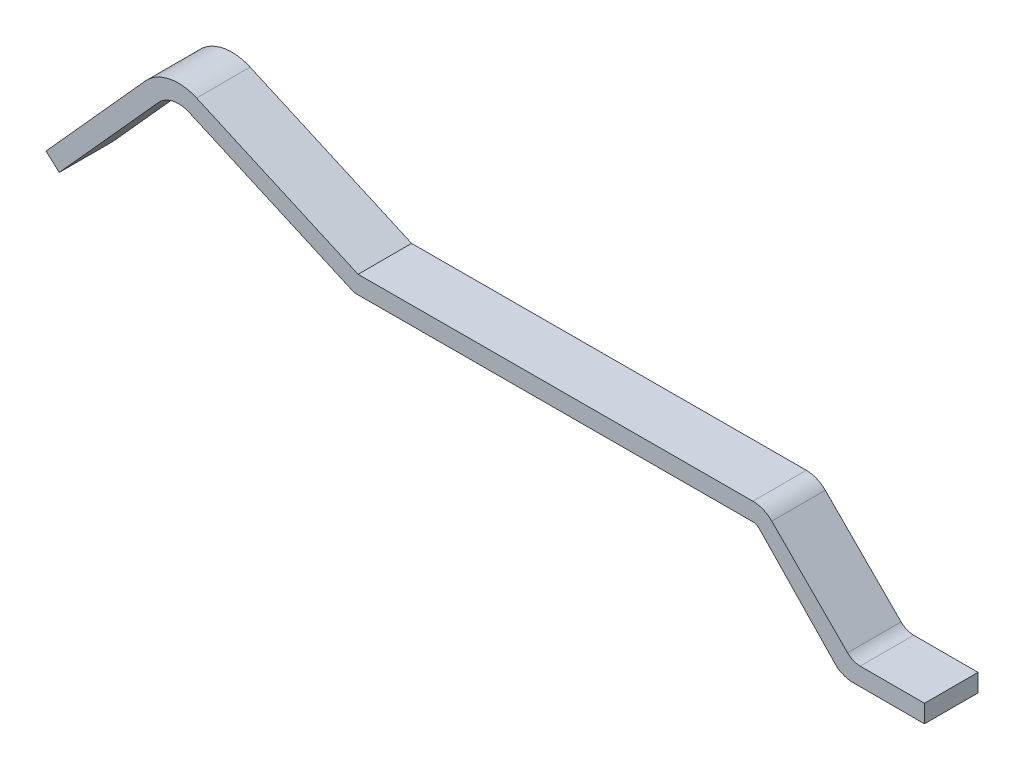
ISO-10303-21;
HEADER;
FILE_DESCRIPTION(('STEP AP214'),'2;1');
FILE_NAME('part.step','',(''),(''),'','','');
FILE_SCHEMA(('AUTOMOTIVE_DESIGN { 1 0 10303 214 1 1 1 1 }'));
ENDSEC;
DATA;
#1=APPLICATION_CONTEXT('core data for automotive mechanical design processes');
#2=APPLICATION_PROTOCOL_DEFINITION('international standard','automotive_design',2000,#1);
#3=PRODUCT_CONTEXT('',#1,'mechanical');
#4=PRODUCT('Part','Part','',(#3));
#5=PRODUCT_RELATED_PRODUCT_CATEGORY('part','',(#4));
#6=PRODUCT_DEFINITION_FORMATION('','',#4);
#7=PRODUCT_DEFINITION_CONTEXT('part definition',#1,'design');
#8=PRODUCT_DEFINITION('design','',#6,#7);
#9=PRODUCT_DEFINITION_SHAPE('','',#8);
#10=(LENGTH_UNIT() NAMED_UNIT(*) SI_UNIT(.MILLI.,.METRE.));
#11=(NAMED_UNIT(*) PLANE_ANGLE_UNIT() SI_UNIT($,.RADIAN.));
#12=(NAMED_UNIT(*) SI_UNIT($,.STERADIAN.) SOLID_ANGLE_UNIT());
#13=UNCERTAINTY_MEASURE_WITH_UNIT(LENGTH_MEASURE(1.E-05),#10,'distance_accuracy_value','');
#14=(GEOMETRIC_REPRESENTATION_CONTEXT(3) GLOBAL_UNCERTAINTY_ASSIGNED_CONTEXT((#13)) GLOBAL_UNIT_ASSIGNED_CONTEXT((#10,
#11,#12)) REPRESENTATION_CONTEXT('',''));
#15=CARTESIAN_POINT('',(0.,0.,0.));
#16=DIRECTION('',(0.,0.,1.));
#17=DIRECTION('',(1.,0.,0.));
#18=AXIS2_PLACEMENT_3D('',#15,#16,#17);
#19=CARTESIAN_POINT('',(18.078994901728,0.200000000000047,0.3));
#20=DIRECTION('',(0.,-1.,0.));
#21=DIRECTION('',(1.,0.,0.));
#22=AXIS2_PLACEMENT_3D('',#19,#20,#21);
#23=PLANE('',#22);
#24=DIRECTION('',(0.,0.,-1.));
#25=VECTOR('',#24,1.);
#26=CARTESIAN_POINT('',(18.078994901728,0.200000000000048,0.3));
#27=LINE('',#26,#25);
#28=CARTESIAN_POINT('',(18.078994901728,0.200000000000047,-0.3));
#29=VERTEX_POINT('',#28);
#30=CARTESIAN_POINT('',(18.078994901728,0.200000000000047,0.3));
#31=VERTEX_POINT('',#30);
#32=EDGE_CURVE('E232',#29,#31,#27,.F.);
#33=ORIENTED_EDGE('',*,*,#32,.T.);
#34=DIRECTION('',(-1.,0.,0.));
#35=VECTOR('',#34,1.);
#36=CARTESIAN_POINT('',(18.,0.200000000000047,0.3));
#37=LINE('',#36,#35);
#38=CARTESIAN_POINT('',(18.8,0.200000000000047,0.3));
#39=VERTEX_POINT('',#38);
#40=EDGE_CURVE('E188',#31,#39,#37,.F.);
#41=ORIENTED_EDGE('',*,*,#40,.T.);
#42=DIRECTION('',(0.,0.,1.));
#43=VECTOR('',#42,1.);
#44=CARTESIAN_POINT('',(18.8,0.200000000000047,0.3));
#45=LINE('',#44,#43);
#46=CARTESIAN_POINT('',(18.8,0.200000000000047,-0.3));
#47=VERTEX_POINT('',#46);
#48=EDGE_CURVE('E276',#39,#47,#45,.F.);
#49=ORIENTED_EDGE('',*,*,#48,.T.);
#50=DIRECTION('',(-1.,0.,0.));
#51=VECTOR('',#50,1.);
#52=CARTESIAN_POINT('',(18.,0.200000000000047,-0.3));
#53=LINE('',#52,#51);
#54=EDGE_CURVE('E271',#29,#47,#53,.F.);
#55=ORIENTED_EDGE('',*,*,#54,.F.);
#56=EDGE_LOOP('',(#33,#41,#49,#55));
#57=FACE_BOUND('',#56,.T.);
#58=ADVANCED_FACE('F17',(#57),#23,.F.);
#59=CARTESIAN_POINT('',(18.8,0.200000000000047,0.3));
#60=DIRECTION('',(-1.,0.,0.));
#61=DIRECTION('',(0.,0.,1.));
#62=AXIS2_PLACEMENT_3D('',#59,#60,#61);
#63=PLANE('',#62);
#64=ORIENTED_EDGE('',*,*,#48,.F.);
#65=DIRECTION('',(0.,1.,0.));
#66=VECTOR('',#65,1.);
#67=CARTESIAN_POINT('',(18.8,0.300000000000376,0.3));
#68=LINE('',#67,#66);
#69=CARTESIAN_POINT('',(18.8,0.,0.3));
#70=VERTEX_POINT('',#69);
#71=EDGE_CURVE('E226',#39,#70,#68,.F.);
#72=ORIENTED_EDGE('',*,*,#71,.T.);
#73=DIRECTION('',(0.,0.,1.));
#74=VECTOR('',#73,1.);
#75=CARTESIAN_POINT('',(18.8,0.,0.3));
#76=LINE('',#75,#74);
#77=CARTESIAN_POINT('',(18.8,0.,-0.3));
#78=VERTEX_POINT('',#77);
#79=EDGE_CURVE('E97',#70,#78,#76,.F.);
#80=ORIENTED_EDGE('',*,*,#79,.T.);
#81=DIRECTION('',(0.,1.,0.));
#82=VECTOR('',#81,1.);
#83=CARTESIAN_POINT('',(18.8,0.300000000000376,-0.3));
#84=LINE('',#83,#82);
#85=EDGE_CURVE('E279',#47,#78,#84,.F.);
#86=ORIENTED_EDGE('',*,*,#85,.F.);
#87=EDGE_LOOP('',(#64,#72,#80,#86));
#88=FACE_BOUND('',#87,.T.);
#89=ADVANCED_FACE('F343',(#88),#63,.F.);
#90=CARTESIAN_POINT('',(18.8,0.,0.3));
#91=DIRECTION('',(0.,1.,0.));
#92=DIRECTION('',(-1.,0.,0.));
#93=AXIS2_PLACEMENT_3D('',#90,#91,#92);
#94=PLANE('',#93);
#95=ORIENTED_EDGE('',*,*,#79,.F.);
#96=DIRECTION('',(-1.,0.,0.));
#97=VECTOR('',#96,1.);
#98=CARTESIAN_POINT('',(18.,0.,0.3));
#99=LINE('',#98,#97);
#100=CARTESIAN_POINT('',(18.,0.,0.3));
#101=VERTEX_POINT('',#100);
#102=EDGE_CURVE('E224',#70,#101,#99,.T.);
#103=ORIENTED_EDGE('',*,*,#102,.T.);
#104=DIRECTION('',(0.,0.,-1.));
#105=VECTOR('',#104,1.);
#106=CARTESIAN_POINT('',(18.,0.,0.3));
#107=LINE('',#106,#105);
#108=CARTESIAN_POINT('',(18.,0.,-0.3));
#109=VERTEX_POINT('',#108);
#110=EDGE_CURVE('E87',#109,#101,#107,.F.);
#111=ORIENTED_EDGE('',*,*,#110,.F.);
#112=DIRECTION('',(-1.,0.,0.));
#113=VECTOR('',#112,1.);
#114=CARTESIAN_POINT('',(18.,0.,-0.3));
#115=LINE('',#114,#113);
#116=EDGE_CURVE('E282',#78,#109,#115,.T.);
#117=ORIENTED_EDGE('',*,*,#116,.F.);
#118=EDGE_LOOP('',(#95,#103,#111,#117));
#119=FACE_BOUND('',#118,.T.);
#120=ADVANCED_FACE('F344',(#119),#94,.F.);
#121=CARTESIAN_POINT('',(18.,0.300000000000376,0.3));
#122=DIRECTION('',(0.,0.,-1.));
#123=DIRECTION('',(-1.,0.,0.));
#124=AXIS2_PLACEMENT_3D('',#121,#122,#123);
#125=CYLINDRICAL_SURFACE('',#124,0.300000000000359);
#126=CARTESIAN_POINT('',(18.,0.300000000000376,0.3));
#127=DIRECTION('',(0.,0.,-1.));
#128=DIRECTION('',(-1.,0.,0.));
#129=AXIS2_PLACEMENT_3D('',#126,#127,#128);
#130=CIRCLE('',#129,0.300000000000359);
#131=CARTESIAN_POINT('',(17.82,0.0599999999999437,0.3));
#132=VERTEX_POINT('',#131);
#133=EDGE_CURVE('E20',#101,#132,#130,.T.);
#134=ORIENTED_EDGE('',*,*,#133,.T.);
#135=DIRECTION('',(0.,0.,1.));
#136=VECTOR('',#135,1.);
#137=CARTESIAN_POINT('',(17.82,0.0599999999999465,0.3));
#138=LINE('',#137,#136);
#139=CARTESIAN_POINT('',(17.82,0.0599999999999437,-0.3));
#140=VERTEX_POINT('',#139);
#141=EDGE_CURVE('E160',#132,#140,#138,.F.);
#142=ORIENTED_EDGE('',*,*,#141,.T.);
#143=CARTESIAN_POINT('',(18.,0.300000000000376,-0.3));
#144=DIRECTION('',(0.,0.,-1.));
#145=DIRECTION('',(-1.,0.,0.));
#146=AXIS2_PLACEMENT_3D('',#143,#144,#145);
#147=CIRCLE('',#146,0.300000000000359);
#148=EDGE_CURVE('E306',#109,#140,#147,.T.);
#149=ORIENTED_EDGE('',*,*,#148,.F.);
#150=ORIENTED_EDGE('',*,*,#110,.T.);
#151=EDGE_LOOP('',(#134,#142,#149,#150));
#152=FACE_BOUND('',#151,.T.);
#153=ADVANCED_FACE('F346',(#152),#125,.T.);
#154=CARTESIAN_POINT('',(17.82,0.0599999999999465,0.3));
#155=DIRECTION('',(0.721675803920417,0.692231199842813,0.));
#156=DIRECTION('',(-0.692231199842813,0.721675803920417,0.));
#157=AXIS2_PLACEMENT_3D('',#154,#155,#156);
#158=PLANE('',#157);
#159=ORIENTED_EDGE('',*,*,#141,.F.);
#160=DIRECTION('',(-0.692231199842813,0.721675803920417,0.));
#161=VECTOR('',#160,1.);
#162=CARTESIAN_POINT('',(17.82,0.0599999999999465,0.3));
#163=LINE('',#162,#161);
#164=CARTESIAN_POINT('',(16.9464466094064,0.970710678119103,0.3));
#165=VERTEX_POINT('',#164);
#166=EDGE_CURVE('E172',#132,#165,#163,.T.);
#167=ORIENTED_EDGE('',*,*,#166,.T.);
#168=DIRECTION('',(0.,0.,-1.));
#169=VECTOR('',#168,1.);
#170=CARTESIAN_POINT('',(16.9464466094068,0.97071067811864,0.3));
#171=LINE('',#170,#169);
#172=CARTESIAN_POINT('',(16.9464466094064,0.970710678119103,-0.3));
#173=VERTEX_POINT('',#172);
#174=EDGE_CURVE('E268',#165,#173,#171,.T.);
#175=ORIENTED_EDGE('',*,*,#174,.T.);
#176=DIRECTION('',(-0.692231199842813,0.721675803920417,0.));
#177=VECTOR('',#176,1.);
#178=CARTESIAN_POINT('',(17.82,0.0599999999999465,-0.3));
#179=LINE('',#178,#177);
#180=EDGE_CURVE('E305',#140,#173,#179,.T.);
#181=ORIENTED_EDGE('',*,*,#180,.F.);
#182=EDGE_LOOP('',(#159,#167,#175,#181));
#183=FACE_BOUND('',#182,.T.);
#184=ADVANCED_FACE('F349',(#183),#158,.F.);
#185=CARTESIAN_POINT('',(12.407488687666,0.99,0.3));
#186=DIRECTION('',(0.40673664307565,0.913545457642668,0.));
#187=DIRECTION('',(-0.913545457642668,0.40673664307565,0.));
#188=AXIS2_PLACEMENT_3D('',#185,#186,#187);
#189=PLANE('',#188);
#190=DIRECTION('',(0.,0.,1.));
#191=VECTOR('',#190,1.);
#192=CARTESIAN_POINT('',(12.407488687666,0.99,0.3));
#193=LINE('',#192,#191);
#194=CARTESIAN_POINT('',(12.407488687666,0.99,0.3));
#195=VERTEX_POINT('',#194);
#196=CARTESIAN_POINT('',(12.407488687666,0.99,-0.3));
#197=VERTEX_POINT('',#196);
#198=EDGE_CURVE('E151',#195,#197,#193,.F.);
#199=ORIENTED_EDGE('',*,*,#198,.F.);
#200=DIRECTION('',(-0.913545457642668,0.40673664307565,0.));
#201=VECTOR('',#200,1.);
#202=CARTESIAN_POINT('',(12.407488687666,0.99,0.3));
#203=LINE('',#202,#201);
#204=CARTESIAN_POINT('',(10.5579715524435,1.81345808257036,0.3));
#205=VERTEX_POINT('',#204);
#206=EDGE_CURVE('E155',#195,#205,#203,.T.);
#207=ORIENTED_EDGE('',*,*,#206,.T.);
#208=DIRECTION('',(0.,0.,-1.));
#209=VECTOR('',#208,1.);
#210=CARTESIAN_POINT('',(10.5579715524435,1.81345808257035,0.3));
#211=LINE('',#210,#209);
#212=CARTESIAN_POINT('',(10.5579715524435,1.81345808257036,-0.3));
#213=VERTEX_POINT('',#212);
#214=EDGE_CURVE('E159',#205,#213,#211,.T.);
#215=ORIENTED_EDGE('',*,*,#214,.T.);
#216=DIRECTION('',(-0.913545457642668,0.40673664307565,0.));
#217=VECTOR('',#216,1.);
#218=CARTESIAN_POINT('',(12.407488687666,0.99,-0.3));
#219=LINE('',#218,#217);
#220=EDGE_CURVE('E156',#197,#213,#219,.T.);
#221=ORIENTED_EDGE('',*,*,#220,.F.);
#222=EDGE_LOOP('',(#199,#207,#215,#221));
#223=FACE_BOUND('',#222,.T.);
#224=ADVANCED_FACE('F153',(#223),#189,.F.);
#225=CARTESIAN_POINT('',(10.4359505595208,1.53939444527741,0.3));
#226=DIRECTION('',(0.,0.,-1.));
#227=DIRECTION('',(-1.,0.,0.));
#228=AXIS2_PLACEMENT_3D('',#225,#226,#227);
#229=CYLINDRICAL_SURFACE('',#228,0.300000000000163);
#230=ORIENTED_EDGE('',*,*,#214,.F.);
#231=CARTESIAN_POINT('',(10.4359505595208,1.53939444527741,0.3));
#232=DIRECTION('',(0.,0.,-1.));
#233=DIRECTION('',(-1.,0.,0.));
#234=AXIS2_PLACEMENT_3D('',#231,#232,#233);
#235=CIRCLE('',#234,0.300000000000163);
#236=CARTESIAN_POINT('',(10.2130071118774,1.74013362718514,0.3));
#237=VERTEX_POINT('',#236);
#238=EDGE_CURVE('E171',#205,#237,#235,.F.);
#239=ORIENTED_EDGE('',*,*,#238,.T.);
#240=DIRECTION('',(0.,0.,1.));
#241=VECTOR('',#240,1.);
#242=CARTESIAN_POINT('',(10.2130071118774,1.74013362718514,0.3));
#243=LINE('',#242,#241);
#244=CARTESIAN_POINT('',(10.2130071118774,1.74013362718514,-0.3));
#245=VERTEX_POINT('',#244);
#246=EDGE_CURVE('E261',#237,#245,#243,.F.);
#247=ORIENTED_EDGE('',*,*,#246,.T.);
#248=CARTESIAN_POINT('',(10.4359505595208,1.53939444527741,-0.3));
#249=DIRECTION('',(0.,0.,-1.));
#250=DIRECTION('',(-1.,0.,0.));
#251=AXIS2_PLACEMENT_3D('',#248,#249,#250);
#252=CIRCLE('',#251,0.300000000000163);
#253=EDGE_CURVE('E134',#213,#245,#252,.F.);
#254=ORIENTED_EDGE('',*,*,#253,.F.);
#255=EDGE_LOOP('',(#230,#239,#247,#254));
#256=FACE_BOUND('',#255,.T.);
#257=ADVANCED_FACE('F315',(#256),#229,.F.);
#258=CARTESIAN_POINT('',(10.2130071118774,1.74013362718514,0.3));
#259=DIRECTION('',(-0.743144825477495,0.669130606358746,0.));
#260=DIRECTION('',(-0.669130606358746,-0.743144825477495,0.));
#261=AXIS2_PLACEMENT_3D('',#258,#259,#260);
#262=PLANE('',#261);
#263=ORIENTED_EDGE('',*,*,#246,.F.);
#264=DIRECTION('',(-0.669130606358745,-0.743144825477496,0.));
#265=VECTOR('',#264,1.);
#266=CARTESIAN_POINT('',(10.2130071118774,1.74013362718514,0.3));
#267=LINE('',#266,#265);
#268=CARTESIAN_POINT('',(9.09953182556442,0.503494039252559,0.3));
#269=VERTEX_POINT('',#268);
#270=EDGE_CURVE('E216',#237,#269,#267,.T.);
#271=ORIENTED_EDGE('',*,*,#270,.T.);
#272=DIRECTION('',(0.,0.,1.));
#273=VECTOR('',#272,1.);
#274=CARTESIAN_POINT('',(9.09953182556442,0.50349403925256,0.3));
#275=LINE('',#274,#273);
#276=CARTESIAN_POINT('',(9.09953182556442,0.503494039252559,-0.3));
#277=VERTEX_POINT('',#276);
#278=EDGE_CURVE('E252',#269,#277,#275,.F.);
#279=ORIENTED_EDGE('',*,*,#278,.T.);
#280=DIRECTION('',(-0.669130606358745,-0.743144825477496,0.));
#281=VECTOR('',#280,1.);
#282=CARTESIAN_POINT('',(10.2130071118774,1.74013362718514,-0.3));
#283=LINE('',#282,#281);
#284=EDGE_CURVE('E139',#245,#277,#283,.T.);
#285=ORIENTED_EDGE('',*,*,#284,.F.);
#286=EDGE_LOOP('',(#263,#271,#279,#285));
#287=FACE_BOUND('',#286,.T.);
#288=ADVANCED_FACE('F317',(#287),#262,.F.);
#289=CARTESIAN_POINT('',(9.09953182556442,0.50349403925256,0.3));
#290=DIRECTION('',(0.669130606358746,0.743144825477495,0.));
#291=DIRECTION('',(-0.743144825477495,0.669130606358746,0.));
#292=AXIS2_PLACEMENT_3D('',#289,#290,#291);
#293=PLANE('',#292);
#294=ORIENTED_EDGE('',*,*,#278,.F.);
#295=DIRECTION('',(-0.743144825477496,0.669130606358746,0.));
#296=VECTOR('',#295,1.);
#297=CARTESIAN_POINT('',(9.09953182556442,0.50349403925256,0.3));
#298=LINE('',#297,#296);
#299=CARTESIAN_POINT('',(8.95090286046869,0.63732016052452,0.3));
#300=VERTEX_POINT('',#299);
#301=EDGE_CURVE('E213',#269,#300,#298,.T.);
#302=ORIENTED_EDGE('',*,*,#301,.T.);
#303=DIRECTION('',(0.,0.,1.));
#304=VECTOR('',#303,1.);
#305=CARTESIAN_POINT('',(8.95090286046869,0.63732016052452,0.3));
#306=LINE('',#305,#304);
#307=CARTESIAN_POINT('',(8.95090286046869,0.63732016052452,-0.3));
#308=VERTEX_POINT('',#307);
#309=EDGE_CURVE('E249',#300,#308,#306,.F.);
#310=ORIENTED_EDGE('',*,*,#309,.T.);
#311=DIRECTION('',(-0.743144825477496,0.669130606358746,0.));
#312=VECTOR('',#311,1.);
#313=CARTESIAN_POINT('',(9.09953182556442,0.50349403925256,-0.3));
#314=LINE('',#313,#312);
#315=EDGE_CURVE('E255',#277,#308,#314,.T.);
#316=ORIENTED_EDGE('',*,*,#315,.F.);
#317=EDGE_LOOP('',(#294,#302,#310,#316));
#318=FACE_BOUND('',#317,.T.);
#319=ADVANCED_FACE('F387',(#318),#293,.F.);
#320=CARTESIAN_POINT('',(8.95090286046869,0.63732016052452,0.3));
#321=DIRECTION('',(0.743144825477361,-0.669130606358895,0.));
#322=DIRECTION('',(0.669130606358895,0.743144825477361,0.));
#323=AXIS2_PLACEMENT_3D('',#320,#321,#322);
#324=PLANE('',#323);
#325=ORIENTED_EDGE('',*,*,#309,.F.);
#326=DIRECTION('',(0.669130606358895,0.743144825477361,0.));
#327=VECTOR('',#326,1.);
#328=CARTESIAN_POINT('',(8.95090286046869,0.63732016052452,0.3));
#329=LINE('',#328,#327);
#330=CARTESIAN_POINT('',(10.064378146782,1.87395974845693,0.3));
#331=VERTEX_POINT('',#330);
#332=EDGE_CURVE('E210',#300,#331,#329,.T.);
#333=ORIENTED_EDGE('',*,*,#332,.T.);
#334=DIRECTION('',(0.,0.,-1.));
#335=VECTOR('',#334,1.);
#336=CARTESIAN_POINT('',(10.0643781467819,1.87395974845692,0.3));
#337=LINE('',#336,#335);
#338=CARTESIAN_POINT('',(10.064378146782,1.87395974845693,-0.3));
#339=VERTEX_POINT('',#338);
#340=EDGE_CURVE('E247',#339,#331,#337,.F.);
#341=ORIENTED_EDGE('',*,*,#340,.F.);
#342=DIRECTION('',(0.669130606358895,0.743144825477361,0.));
#343=VECTOR('',#342,1.);
#344=CARTESIAN_POINT('',(8.95090286046869,0.63732016052452,-0.3));
#345=LINE('',#344,#343);
#346=EDGE_CURVE('E257',#308,#339,#345,.T.);
#347=ORIENTED_EDGE('',*,*,#346,.F.);
#348=EDGE_LOOP('',(#325,#333,#341,#347));
#349=FACE_BOUND('',#348,.T.);
#350=ADVANCED_FACE('F384',(#349),#324,.F.);
#351=CARTESIAN_POINT('',(10.4359505595208,1.53939444527736,0.3));
#352=DIRECTION('',(0.,0.,-1.));
#353=DIRECTION('',(-1.,0.,0.));
#354=AXIS2_PLACEMENT_3D('',#351,#352,#353);
#355=CYLINDRICAL_SURFACE('',#354,0.50000000000019);
#356=CARTESIAN_POINT('',(10.4359505595208,1.53939444527736,0.3));
#357=DIRECTION('',(0.,0.,-1.));
#358=DIRECTION('',(-1.,0.,0.));
#359=AXIS2_PLACEMENT_3D('',#356,#357,#358);
#360=CIRCLE('',#359,0.50000000000019);
#361=CARTESIAN_POINT('',(10.6393188810587,1.99616717409889,0.3));
#362=VERTEX_POINT('',#361);
#363=EDGE_CURVE('E207',#331,#362,#360,.T.);
#364=ORIENTED_EDGE('',*,*,#363,.T.);
#365=DIRECTION('',(0.,0.,1.));
#366=VECTOR('',#365,1.);
#367=CARTESIAN_POINT('',(10.6393188810586,1.9961671740989,0.3));
#368=LINE('',#367,#366);
#369=CARTESIAN_POINT('',(10.6393188810587,1.99616717409889,-0.3));
#370=VERTEX_POINT('',#369);
#371=EDGE_CURVE('E242',#362,#370,#368,.F.);
#372=ORIENTED_EDGE('',*,*,#371,.T.);
#373=CARTESIAN_POINT('',(10.4359505595208,1.53939444527736,-0.3));
#374=DIRECTION('',(0.,0.,-1.));
#375=DIRECTION('',(-1.,0.,0.));
#376=AXIS2_PLACEMENT_3D('',#373,#374,#375);
#377=CIRCLE('',#376,0.50000000000019);
#378=EDGE_CURVE('E300',#339,#370,#377,.T.);
#379=ORIENTED_EDGE('',*,*,#378,.F.);
#380=ORIENTED_EDGE('',*,*,#340,.T.);
#381=EDGE_LOOP('',(#364,#372,#379,#380));
#382=FACE_BOUND('',#381,.T.);
#383=ADVANCED_FACE('F378',(#382),#355,.T.);
#384=CARTESIAN_POINT('',(10.6393188810586,1.9961671740989,0.3));
#385=DIRECTION('',(-0.40673664307565,-0.913545457642668,0.));
#386=DIRECTION('',(0.913545457642668,-0.40673664307565,0.));
#387=AXIS2_PLACEMENT_3D('',#384,#385,#386);
#388=PLANE('',#387);
#389=ORIENTED_EDGE('',*,*,#371,.F.);
#390=DIRECTION('',(0.913545457642667,-0.406736643075651,0.));
#391=VECTOR('',#390,1.);
#392=CARTESIAN_POINT('',(10.6393188810586,1.9961671740989,0.3));
#393=LINE('',#392,#391);
#394=CARTESIAN_POINT('',(12.4499999999999,1.19000000000005,0.3));
#395=VERTEX_POINT('',#394);
#396=EDGE_CURVE('E202',#362,#395,#393,.T.);
#397=ORIENTED_EDGE('',*,*,#396,.T.);
#398=DIRECTION('',(0.,0.,1.));
#399=VECTOR('',#398,1.);
#400=CARTESIAN_POINT('',(12.4499999999999,1.19000000000005,0.3));
#401=LINE('',#400,#399);
#402=CARTESIAN_POINT('',(12.4499999999999,1.19000000000005,-0.3));
#403=VERTEX_POINT('',#402);
#404=EDGE_CURVE('E239',#395,#403,#401,.F.);
#405=ORIENTED_EDGE('',*,*,#404,.T.);
#406=DIRECTION('',(0.913545457642667,-0.406736643075651,0.));
#407=VECTOR('',#406,1.);
#408=CARTESIAN_POINT('',(10.6393188810586,1.9961671740989,-0.3));
#409=LINE('',#408,#407);
#410=EDGE_CURVE('E302',#370,#403,#409,.T.);
#411=ORIENTED_EDGE('',*,*,#410,.F.);
#412=EDGE_LOOP('',(#389,#397,#405,#411));
#413=FACE_BOUND('',#412,.T.);
#414=ADVANCED_FACE('F373',(#413),#388,.F.);
#415=CARTESIAN_POINT('',(12.4499999999999,1.19000000000005,0.3));
#416=DIRECTION('',(0.00225950545359492,-0.999997447314295,0.));
#417=DIRECTION('',(0.999997447314295,0.00225950545359492,0.));
#418=AXIS2_PLACEMENT_3D('',#415,#416,#417);
#419=PLANE('',#418);
#420=ORIENTED_EDGE('',*,*,#404,.F.);
#421=DIRECTION('',(0.999997447314295,0.00225950545359492,0.));
#422=VECTOR('',#421,1.);
#423=CARTESIAN_POINT('',(12.4499999999999,1.19000000000005,0.3));
#424=LINE('',#423,#422);
#425=CARTESIAN_POINT('',(16.8757359312881,1.19999999999982,0.3));
#426=VERTEX_POINT('',#425);
#427=EDGE_CURVE('E199',#395,#426,#424,.T.);
#428=ORIENTED_EDGE('',*,*,#427,.T.);
#429=DIRECTION('',(0.,0.,-1.));
#430=VECTOR('',#429,1.);
#431=CARTESIAN_POINT('',(16.8757359312881,1.19999999999982,0.3));
#432=LINE('',#431,#430);
#433=CARTESIAN_POINT('',(16.8757359312881,1.19999999999982,-0.3));
#434=VERTEX_POINT('',#433);
#435=EDGE_CURVE('E237',#434,#426,#432,.F.);
#436=ORIENTED_EDGE('',*,*,#435,.F.);
#437=DIRECTION('',(0.999997447314295,0.00225950545359492,0.));
#438=VECTOR('',#437,1.);
#439=CARTESIAN_POINT('',(12.4499999999999,1.19000000000005,-0.3));
#440=LINE('',#439,#438);
#441=EDGE_CURVE('E299',#403,#434,#440,.T.);
#442=ORIENTED_EDGE('',*,*,#441,.F.);
#443=EDGE_LOOP('',(#420,#428,#436,#442));
#444=FACE_BOUND('',#443,.T.);
#445=ADVANCED_FACE('F368',(#444),#419,.F.);
#446=CARTESIAN_POINT('',(16.8764101070644,0.901627604302296,0.3));
#447=DIRECTION('',(0.,0.,-1.));
#448=DIRECTION('',(-1.,0.,0.));
#449=AXIS2_PLACEMENT_3D('',#446,#447,#448);
#450=CYLINDRICAL_SURFACE('',#449,0.298373157350418);
#451=CARTESIAN_POINT('',(16.8764101070644,0.901627604302296,0.3));
#452=DIRECTION('',(0.,0.,-1.));
#453=DIRECTION('',(-1.,0.,0.));
#454=AXIS2_PLACEMENT_3D('',#451,#452,#453);
#455=CIRCLE('',#454,0.298373157350418);
#456=CARTESIAN_POINT('',(17.0878679656441,1.11213203435578,0.3));
#457=VERTEX_POINT('',#456);
#458=EDGE_CURVE('E198',#426,#457,#455,.T.);
#459=ORIENTED_EDGE('',*,*,#458,.T.);
#460=DIRECTION('',(0.,0.,1.));
#461=VECTOR('',#460,1.);
#462=CARTESIAN_POINT('',(17.0878679656441,1.11213203435578,0.3));
#463=LINE('',#462,#461);
#464=CARTESIAN_POINT('',(17.0878679656441,1.11213203435578,-0.3));
#465=VERTEX_POINT('',#464);
#466=EDGE_CURVE('E234',#457,#465,#463,.F.);
#467=ORIENTED_EDGE('',*,*,#466,.T.);
#468=CARTESIAN_POINT('',(16.8764101070644,0.901627604302296,-0.3));
#469=DIRECTION('',(0.,0.,-1.));
#470=DIRECTION('',(-1.,0.,0.));
#471=AXIS2_PLACEMENT_3D('',#468,#469,#470);
#472=CIRCLE('',#471,0.298373157350418);
#473=EDGE_CURVE('E297',#434,#465,#472,.T.);
#474=ORIENTED_EDGE('',*,*,#473,.F.);
#475=ORIENTED_EDGE('',*,*,#435,.T.);
#476=EDGE_LOOP('',(#459,#467,#474,#475));
#477=FACE_BOUND('',#476,.T.);
#478=ADVANCED_FACE('F362',(#477),#450,.T.);
#479=CARTESIAN_POINT('',(17.0878679656441,1.11213203435578,0.3));
#480=DIRECTION('',(-0.708702687793621,-0.705507264536729,0.));
#481=DIRECTION('',(0.705507264536729,-0.708702687793621,0.));
#482=AXIS2_PLACEMENT_3D('',#479,#480,#481);
#483=PLANE('',#482);
#484=ORIENTED_EDGE('',*,*,#466,.F.);
#485=DIRECTION('',(0.705507264536727,-0.708702687793622,0.));
#486=VECTOR('',#485,1.);
#487=CARTESIAN_POINT('',(17.0878679656441,1.11213203435578,0.3));
#488=LINE('',#487,#486);
#489=CARTESIAN_POINT('',(17.9372543641692,0.258898547092702,0.3));
#490=VERTEX_POINT('',#489);
#491=EDGE_CURVE('E195',#457,#490,#488,.T.);
#492=ORIENTED_EDGE('',*,*,#491,.T.);
#493=DIRECTION('',(0.,0.,-1.));
#494=VECTOR('',#493,1.);
#495=CARTESIAN_POINT('',(17.9372543641692,0.258898547092702,0.3));
#496=LINE('',#495,#494);
#497=CARTESIAN_POINT('',(17.9372543641692,0.258898547092702,-0.3));
#498=VERTEX_POINT('',#497);
#499=EDGE_CURVE('E229',#490,#498,#496,.T.);
#500=ORIENTED_EDGE('',*,*,#499,.T.);
#501=DIRECTION('',(0.705507264536727,-0.708702687793622,0.));
#502=VECTOR('',#501,1.);
#503=CARTESIAN_POINT('',(17.0878679656441,1.11213203435578,-0.3));
#504=LINE('',#503,#502);
#505=EDGE_CURVE('E181',#465,#498,#504,.T.);
#506=ORIENTED_EDGE('',*,*,#505,.F.);
#507=EDGE_LOOP('',(#484,#492,#500,#506));
#508=FACE_BOUND('',#507,.T.);
#509=ADVANCED_FACE('F358',(#508),#483,.F.);
#510=CARTESIAN_POINT('',(18.078994901728,0.400000000000047,0.3));
#511=DIRECTION('',(0.,0.,-1.));
#512=DIRECTION('',(-1.,0.,0.));
#513=AXIS2_PLACEMENT_3D('',#510,#511,#512);
#514=CYLINDRICAL_SURFACE('',#513,0.199999999999999);
#515=ORIENTED_EDGE('',*,*,#499,.F.);
#516=CARTESIAN_POINT('',(18.078994901728,0.400000000000047,0.3));
#517=DIRECTION('',(0.,0.,-1.));
#518=DIRECTION('',(-1.,0.,0.));
#519=AXIS2_PLACEMENT_3D('',#516,#517,#518);
#520=CIRCLE('',#519,0.199999999999999);
#521=EDGE_CURVE('E192',#490,#31,#520,.F.);
#522=ORIENTED_EDGE('',*,*,#521,.T.);
#523=ORIENTED_EDGE('',*,*,#32,.F.);
#524=CARTESIAN_POINT('',(18.078994901728,0.400000000000047,-0.3));
#525=DIRECTION('',(0.,0.,-1.));
#526=DIRECTION('',(-1.,0.,0.));
#527=AXIS2_PLACEMENT_3D('',#524,#525,#526);
#528=CIRCLE('',#527,0.199999999999999);
#529=EDGE_CURVE('E177',#498,#29,#528,.F.);
#530=ORIENTED_EDGE('',*,*,#529,.F.);
#531=EDGE_LOOP('',(#515,#522,#523,#530));
#532=FACE_BOUND('',#531,.T.);
#533=ADVANCED_FACE('F355',(#532),#514,.F.);
#534=CARTESIAN_POINT('',(18.,0.300000000000376,0.3));
#535=DIRECTION('',(0.,0.,-1.));
#536=DIRECTION('',(-1.,0.,0.));
#537=AXIS2_PLACEMENT_3D('',#534,#535,#536);
#538=PLANE('',#537);
#539=ORIENTED_EDGE('',*,*,#521,.F.);
#540=ORIENTED_EDGE('',*,*,#491,.F.);
#541=ORIENTED_EDGE('',*,*,#458,.F.);
#542=ORIENTED_EDGE('',*,*,#427,.F.);
#543=ORIENTED_EDGE('',*,*,#396,.F.);
#544=ORIENTED_EDGE('',*,*,#363,.F.);
#545=ORIENTED_EDGE('',*,*,#332,.F.);
#546=ORIENTED_EDGE('',*,*,#301,.F.);
#547=ORIENTED_EDGE('',*,*,#270,.F.);
#548=ORIENTED_EDGE('',*,*,#238,.F.);
#549=ORIENTED_EDGE('',*,*,#206,.F.);
#550=DIRECTION('',(-0.999997495656019,-0.00223800842061619,0.));
#551=VECTOR('',#550,1.);
#552=CARTESIAN_POINT('',(16.8757359312874,1.00000000000006,0.3));
#553=LINE('',#552,#551);
#554=CARTESIAN_POINT('',(16.8757359312874,1.00000000000006,0.3));
#555=VERTEX_POINT('',#554);
#556=EDGE_CURVE('E168',#195,#555,#553,.F.);
#557=ORIENTED_EDGE('',*,*,#556,.T.);
#558=CARTESIAN_POINT('',(16.8759585299795,0.900537400779785,0.3));
#559=DIRECTION('',(0.,0.,-1.));
#560=DIRECTION('',(-1.,0.,0.));
#561=AXIS2_PLACEMENT_3D('',#558,#559,#560);
#562=CIRCLE('',#561,0.0994628483094416);
#563=EDGE_CURVE('E191',#555,#165,#562,.T.);
#564=ORIENTED_EDGE('',*,*,#563,.T.);
#565=ORIENTED_EDGE('',*,*,#166,.F.);
#566=ORIENTED_EDGE('',*,*,#133,.F.);
#567=ORIENTED_EDGE('',*,*,#102,.F.);
#568=ORIENTED_EDGE('',*,*,#71,.F.);
#569=ORIENTED_EDGE('',*,*,#40,.F.);
#570=EDGE_LOOP('',(#539,#540,#541,#542,#543,#544,#545,#546,#547,#548,#549,#557,#564,#565,#566,
#567,#568,#569));
#571=FACE_BOUND('',#570,.T.);
#572=ADVANCED_FACE('F166',(#571),#538,.F.);
#573=CARTESIAN_POINT('',(16.8759585299795,0.900537400779785,0.3));
#574=DIRECTION('',(0.,0.,-1.));
#575=DIRECTION('',(-1.,0.,0.));
#576=AXIS2_PLACEMENT_3D('',#573,#574,#575);
#577=CYLINDRICAL_SURFACE('',#576,0.0994628483094416);
#578=ORIENTED_EDGE('',*,*,#174,.F.);
#579=ORIENTED_EDGE('',*,*,#563,.F.);
#580=DIRECTION('',(0.,0.,1.));
#581=VECTOR('',#580,1.);
#582=CARTESIAN_POINT('',(16.8757359312874,1.00000000000006,0.3));
#583=LINE('',#582,#581);
#584=CARTESIAN_POINT('',(16.8757359312874,1.00000000000006,-0.3));
#585=VERTEX_POINT('',#584);
#586=EDGE_CURVE('E26',#555,#585,#583,.F.);
#587=ORIENTED_EDGE('',*,*,#586,.T.);
#588=CARTESIAN_POINT('',(16.8759585299795,0.900537400779785,-0.3));
#589=DIRECTION('',(0.,0.,-1.));
#590=DIRECTION('',(-1.,0.,0.));
#591=AXIS2_PLACEMENT_3D('',#588,#589,#590);
#592=CIRCLE('',#591,0.0994628483094416);
#593=EDGE_CURVE('E34',#173,#585,#592,.F.);
#594=ORIENTED_EDGE('',*,*,#593,.F.);
#595=EDGE_LOOP('',(#578,#579,#587,#594));
#596=FACE_BOUND('',#595,.T.);
#597=ADVANCED_FACE('F352',(#596),#577,.F.);
#598=CARTESIAN_POINT('',(18.,0.300000000000376,-0.3));
#599=DIRECTION('',(0.,0.,-1.));
#600=DIRECTION('',(-1.,0.,0.));
#601=AXIS2_PLACEMENT_3D('',#598,#599,#600);
#602=PLANE('',#601);
#603=ORIENTED_EDGE('',*,*,#505,.T.);
#604=ORIENTED_EDGE('',*,*,#529,.T.);
#605=ORIENTED_EDGE('',*,*,#54,.T.);
#606=ORIENTED_EDGE('',*,*,#85,.T.);
#607=ORIENTED_EDGE('',*,*,#116,.T.);
#608=ORIENTED_EDGE('',*,*,#148,.T.);
#609=ORIENTED_EDGE('',*,*,#180,.T.);
#610=ORIENTED_EDGE('',*,*,#593,.T.);
#611=DIRECTION('',(-0.999997495656019,-0.00223800842061619,0.));
#612=VECTOR('',#611,1.);
#613=CARTESIAN_POINT('',(16.8757359312874,1.00000000000006,-0.3));
#614=LINE('',#613,#612);
#615=EDGE_CURVE('E11',#585,#197,#614,.T.);
#616=ORIENTED_EDGE('',*,*,#615,.T.);
#617=ORIENTED_EDGE('',*,*,#220,.T.);
#618=ORIENTED_EDGE('',*,*,#253,.T.);
#619=ORIENTED_EDGE('',*,*,#284,.T.);
#620=ORIENTED_EDGE('',*,*,#315,.T.);
#621=ORIENTED_EDGE('',*,*,#346,.T.);
#622=ORIENTED_EDGE('',*,*,#378,.T.);
#623=ORIENTED_EDGE('',*,*,#410,.T.);
#624=ORIENTED_EDGE('',*,*,#441,.T.);
#625=ORIENTED_EDGE('',*,*,#473,.T.);
#626=EDGE_LOOP('',(#603,#604,#605,#606,#607,#608,#609,#610,#616,#617,#618,#619,#620,#621,#622,
#623,#624,#625));
#627=FACE_BOUND('',#626,.T.);
#628=ADVANCED_FACE('F336',(#627),#602,.T.);
#629=CARTESIAN_POINT('',(16.8757359312874,1.00000000000006,0.3));
#630=DIRECTION('',(-0.00223800842061619,0.999997495656019,0.));
#631=DIRECTION('',(-0.999997495656019,-0.00223800842061619,0.));
#632=AXIS2_PLACEMENT_3D('',#629,#630,#631);
#633=PLANE('',#632);
#634=ORIENTED_EDGE('',*,*,#586,.F.);
#635=ORIENTED_EDGE('',*,*,#556,.F.);
#636=ORIENTED_EDGE('',*,*,#198,.T.);
#637=ORIENTED_EDGE('',*,*,#615,.F.);
#638=EDGE_LOOP('',(#634,#635,#636,#637));
#639=FACE_BOUND('',#638,.T.);
#640=ADVANCED_FACE('F175',(#639),#633,.F.);
#641=CLOSED_SHELL('',(#58,#89,#120,#153,#184,#224,#257,#288,#319,#350,#383,#414,#445,#478,#509,
#533,#572,#597,#628,#640));
#642=MANIFOLD_SOLID_BREP('B1',#641);
#643=ADVANCED_BREP_SHAPE_REPRESENTATION('',(#18,#642),#14);
#644=SHAPE_DEFINITION_REPRESENTATION(#9,#643);
ENDSEC;
END-ISO-10303-21;
